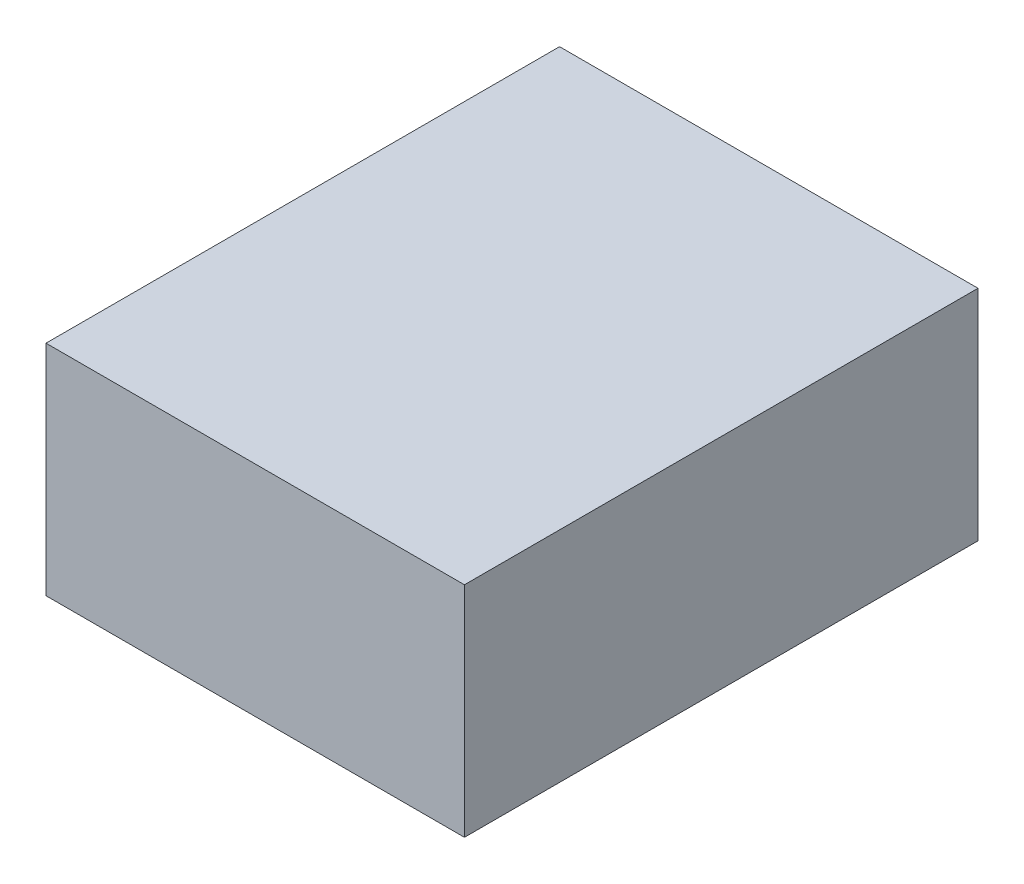
ISO-10303-21;
HEADER;
FILE_DESCRIPTION(('STEP AP214'),'2;1');
FILE_NAME('part.step','',(''),(''),'','','');
FILE_SCHEMA(('AUTOMOTIVE_DESIGN { 1 0 10303 214 1 1 1 1 }'));
ENDSEC;
DATA;
#1=APPLICATION_CONTEXT('core data for automotive mechanical design processes');
#2=APPLICATION_PROTOCOL_DEFINITION('international standard','automotive_design',2000,#1);
#3=PRODUCT_CONTEXT('',#1,'mechanical');
#4=PRODUCT('Part','Part','',(#3));
#5=PRODUCT_RELATED_PRODUCT_CATEGORY('part','',(#4));
#6=PRODUCT_DEFINITION_FORMATION('','',#4);
#7=PRODUCT_DEFINITION_CONTEXT('part definition',#1,'design');
#8=PRODUCT_DEFINITION('design','',#6,#7);
#9=PRODUCT_DEFINITION_SHAPE('','',#8);
#10=(LENGTH_UNIT() NAMED_UNIT(*) SI_UNIT(.MILLI.,.METRE.));
#11=(NAMED_UNIT(*) PLANE_ANGLE_UNIT() SI_UNIT($,.RADIAN.));
#12=(NAMED_UNIT(*) SI_UNIT($,.STERADIAN.) SOLID_ANGLE_UNIT());
#13=UNCERTAINTY_MEASURE_WITH_UNIT(LENGTH_MEASURE(1.E-05),#10,'distance_accuracy_value','');
#14=(GEOMETRIC_REPRESENTATION_CONTEXT(3) GLOBAL_UNCERTAINTY_ASSIGNED_CONTEXT((#13)) GLOBAL_UNIT_ASSIGNED_CONTEXT((#10,
#11,#12)) REPRESENTATION_CONTEXT('',''));
#15=CARTESIAN_POINT('',(0.,0.,0.));
#16=DIRECTION('',(0.,0.,1.));
#17=DIRECTION('',(1.,0.,0.));
#18=AXIS2_PLACEMENT_3D('',#15,#16,#17);
#19=CARTESIAN_POINT('',(-40.0594138260593,20.541095890411,27.));
#20=DIRECTION('',(1.,0.,0.));
#21=DIRECTION('',(0.,0.,-1.));
#22=AXIS2_PLACEMENT_3D('',#19,#20,#21);
#23=PLANE('',#22);
#24=DIRECTION('',(0.,-1.,0.));
#25=VECTOR('',#24,1.);
#26=CARTESIAN_POINT('',(-40.0594138260593,20.541095890411,0.));
#27=LINE('',#26,#25);
#28=CARTESIAN_POINT('',(-40.0594138260593,20.541095890411,0.));
#29=VERTEX_POINT('',#28);
#30=CARTESIAN_POINT('',(-40.0594138260593,9.04109589041096,0.));
#31=VERTEX_POINT('',#30);
#32=EDGE_CURVE('E107',#29,#31,#27,.T.);
#33=ORIENTED_EDGE('',*,*,#32,.T.);
#34=DIRECTION('',(0.,0.,-1.));
#35=VECTOR('',#34,1.);
#36=CARTESIAN_POINT('',(-40.0594138260593,9.04109589041096,27.));
#37=LINE('',#36,#35);
#38=CARTESIAN_POINT('',(-40.0594138260593,9.04109589041096,27.));
#39=VERTEX_POINT('',#38);
#40=EDGE_CURVE('E11',#39,#31,#37,.T.);
#41=ORIENTED_EDGE('',*,*,#40,.F.);
#42=DIRECTION('',(0.,-1.,0.));
#43=VECTOR('',#42,1.);
#44=CARTESIAN_POINT('',(-40.0594138260593,20.541095890411,27.));
#45=LINE('',#44,#43);
#46=CARTESIAN_POINT('',(-40.0594138260593,20.541095890411,27.));
#47=VERTEX_POINT('',#46);
#48=EDGE_CURVE('E91',#47,#39,#45,.T.);
#49=ORIENTED_EDGE('',*,*,#48,.F.);
#50=DIRECTION('',(0.,0.,-1.));
#51=VECTOR('',#50,1.);
#52=CARTESIAN_POINT('',(-40.0594138260593,20.541095890411,27.));
#53=LINE('',#52,#51);
#54=EDGE_CURVE('E103',#47,#29,#53,.T.);
#55=ORIENTED_EDGE('',*,*,#54,.T.);
#56=EDGE_LOOP('',(#33,#41,#49,#55));
#57=FACE_BOUND('',#56,.T.);
#58=ADVANCED_FACE('F39',(#57),#23,.F.);
#59=CARTESIAN_POINT('',(-40.0594138260593,9.04109589041096,27.));
#60=DIRECTION('',(0.,1.,0.));
#61=DIRECTION('',(0.,0.,1.));
#62=AXIS2_PLACEMENT_3D('',#59,#60,#61);
#63=PLANE('',#62);
#64=DIRECTION('',(1.,0.,0.));
#65=VECTOR('',#64,1.);
#66=CARTESIAN_POINT('',(-40.0594138260593,9.04109589041096,0.));
#67=LINE('',#66,#65);
#68=CARTESIAN_POINT('',(-18.0594138260593,9.04109589041096,0.));
#69=VERTEX_POINT('',#68);
#70=EDGE_CURVE('E96',#31,#69,#67,.T.);
#71=ORIENTED_EDGE('',*,*,#70,.T.);
#72=DIRECTION('',(0.,0.,-1.));
#73=VECTOR('',#72,1.);
#74=CARTESIAN_POINT('',(-18.0594138260593,9.04109589041096,27.));
#75=LINE('',#74,#73);
#76=CARTESIAN_POINT('',(-18.0594138260593,9.04109589041096,27.));
#77=VERTEX_POINT('',#76);
#78=EDGE_CURVE('E48',#77,#69,#75,.T.);
#79=ORIENTED_EDGE('',*,*,#78,.F.);
#80=DIRECTION('',(1.,0.,0.));
#81=VECTOR('',#80,1.);
#82=CARTESIAN_POINT('',(-40.0594138260593,9.04109589041096,27.));
#83=LINE('',#82,#81);
#84=EDGE_CURVE('E86',#39,#77,#83,.T.);
#85=ORIENTED_EDGE('',*,*,#84,.F.);
#86=ORIENTED_EDGE('',*,*,#40,.T.);
#87=EDGE_LOOP('',(#71,#79,#85,#86));
#88=FACE_BOUND('',#87,.T.);
#89=ADVANCED_FACE('F95',(#88),#63,.F.);
#90=CARTESIAN_POINT('',(-18.0594138260593,20.541095890411,27.));
#91=DIRECTION('',(-1.,0.,0.));
#92=DIRECTION('',(0.,-1.,0.));
#93=AXIS2_PLACEMENT_3D('',#90,#91,#92);
#94=PLANE('',#93);
#95=DIRECTION('',(0.,1.,0.));
#96=VECTOR('',#95,1.);
#97=CARTESIAN_POINT('',(-18.0594138260593,20.541095890411,0.));
#98=LINE('',#97,#96);
#99=CARTESIAN_POINT('',(-18.0594138260593,20.541095890411,0.));
#100=VERTEX_POINT('',#99);
#101=EDGE_CURVE('E73',#69,#100,#98,.T.);
#102=ORIENTED_EDGE('',*,*,#101,.T.);
#103=DIRECTION('',(0.,0.,-1.));
#104=VECTOR('',#103,1.);
#105=CARTESIAN_POINT('',(-18.0594138260593,20.541095890411,27.));
#106=LINE('',#105,#104);
#107=CARTESIAN_POINT('',(-18.0594138260593,20.541095890411,27.));
#108=VERTEX_POINT('',#107);
#109=EDGE_CURVE('E98',#108,#100,#106,.T.);
#110=ORIENTED_EDGE('',*,*,#109,.F.);
#111=DIRECTION('',(0.,1.,0.));
#112=VECTOR('',#111,1.);
#113=CARTESIAN_POINT('',(-18.0594138260593,20.541095890411,27.));
#114=LINE('',#113,#112);
#115=EDGE_CURVE('E89',#77,#108,#114,.T.);
#116=ORIENTED_EDGE('',*,*,#115,.F.);
#117=ORIENTED_EDGE('',*,*,#78,.T.);
#118=EDGE_LOOP('',(#102,#110,#116,#117));
#119=FACE_BOUND('',#118,.T.);
#120=ADVANCED_FACE('F99',(#119),#94,.F.);
#121=CARTESIAN_POINT('',(-40.0594138260593,20.541095890411,27.));
#122=DIRECTION('',(0.,-1.,0.));
#123=DIRECTION('',(0.,0.,-1.));
#124=AXIS2_PLACEMENT_3D('',#121,#122,#123);
#125=PLANE('',#124);
#126=DIRECTION('',(-1.,0.,0.));
#127=VECTOR('',#126,1.);
#128=CARTESIAN_POINT('',(-40.0594138260593,20.541095890411,0.));
#129=LINE('',#128,#127);
#130=EDGE_CURVE('E79',#100,#29,#129,.T.);
#131=ORIENTED_EDGE('',*,*,#130,.T.);
#132=ORIENTED_EDGE('',*,*,#54,.F.);
#133=DIRECTION('',(-1.,0.,0.));
#134=VECTOR('',#133,1.);
#135=CARTESIAN_POINT('',(-40.0594138260593,20.541095890411,27.));
#136=LINE('',#135,#134);
#137=EDGE_CURVE('E56',#108,#47,#136,.T.);
#138=ORIENTED_EDGE('',*,*,#137,.F.);
#139=ORIENTED_EDGE('',*,*,#109,.T.);
#140=EDGE_LOOP('',(#131,#132,#138,#139));
#141=FACE_BOUND('',#140,.T.);
#142=ADVANCED_FACE('F120',(#141),#125,.F.);
#143=CARTESIAN_POINT('',(0.,0.,27.));
#144=DIRECTION('',(0.,0.,1.));
#145=DIRECTION('',(1.,0.,0.));
#146=AXIS2_PLACEMENT_3D('',#143,#144,#145);
#147=PLANE('',#146);
#148=ORIENTED_EDGE('',*,*,#48,.T.);
#149=ORIENTED_EDGE('',*,*,#84,.T.);
#150=ORIENTED_EDGE('',*,*,#115,.T.);
#151=ORIENTED_EDGE('',*,*,#137,.T.);
#152=EDGE_LOOP('',(#148,#149,#150,#151));
#153=FACE_BOUND('',#152,.T.);
#154=ADVANCED_FACE('F87',(#153),#147,.T.);
#155=CARTESIAN_POINT('',(0.,0.,0.));
#156=DIRECTION('',(0.,0.,1.));
#157=DIRECTION('',(1.,0.,0.));
#158=AXIS2_PLACEMENT_3D('',#155,#156,#157);
#159=PLANE('',#158);
#160=ORIENTED_EDGE('',*,*,#32,.F.);
#161=ORIENTED_EDGE('',*,*,#130,.F.);
#162=ORIENTED_EDGE('',*,*,#101,.F.);
#163=ORIENTED_EDGE('',*,*,#70,.F.);
#164=EDGE_LOOP('',(#160,#161,#162,#163));
#165=FACE_BOUND('',#164,.T.);
#166=ADVANCED_FACE('F123',(#165),#159,.F.);
#167=CLOSED_SHELL('',(#58,#89,#120,#142,#154,#166));
#168=MANIFOLD_SOLID_BREP('B2',#167);
#169=ADVANCED_BREP_SHAPE_REPRESENTATION('',(#18,#168),#14);
#170=SHAPE_DEFINITION_REPRESENTATION(#9,#169);
ENDSEC;
END-ISO-10303-21;
